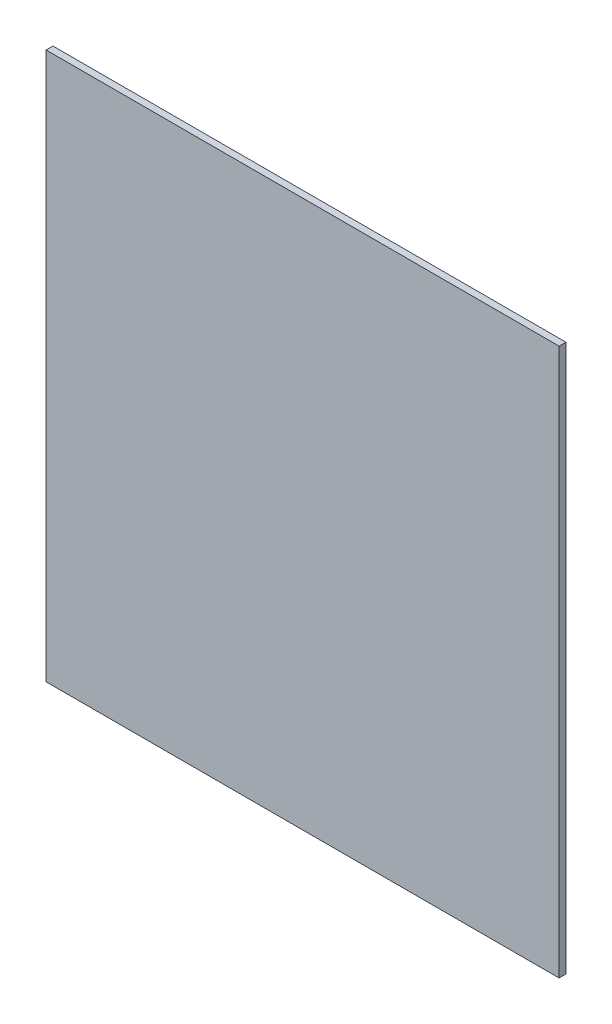
ISO-10303-21;
HEADER;
FILE_DESCRIPTION(('STEP AP214'),'2;1');
FILE_NAME('part.step','',(''),(''),'','','');
FILE_SCHEMA(('AUTOMOTIVE_DESIGN { 1 0 10303 214 1 1 1 1 }'));
ENDSEC;
DATA;
#1=APPLICATION_CONTEXT('core data for automotive mechanical design processes');
#2=APPLICATION_PROTOCOL_DEFINITION('international standard','automotive_design',2000,#1);
#3=PRODUCT_CONTEXT('',#1,'mechanical');
#4=PRODUCT('Part','Part','',(#3));
#5=PRODUCT_RELATED_PRODUCT_CATEGORY('part','',(#4));
#6=PRODUCT_DEFINITION_FORMATION('','',#4);
#7=PRODUCT_DEFINITION_CONTEXT('part definition',#1,'design');
#8=PRODUCT_DEFINITION('design','',#6,#7);
#9=PRODUCT_DEFINITION_SHAPE('','',#8);
#10=(LENGTH_UNIT() NAMED_UNIT(*) SI_UNIT(.MILLI.,.METRE.));
#11=(NAMED_UNIT(*) PLANE_ANGLE_UNIT() SI_UNIT($,.RADIAN.));
#12=(NAMED_UNIT(*) SI_UNIT($,.STERADIAN.) SOLID_ANGLE_UNIT());
#13=UNCERTAINTY_MEASURE_WITH_UNIT(LENGTH_MEASURE(1.E-05),#10,'distance_accuracy_value','');
#14=(GEOMETRIC_REPRESENTATION_CONTEXT(3) GLOBAL_UNCERTAINTY_ASSIGNED_CONTEXT((#13)) GLOBAL_UNIT_ASSIGNED_CONTEXT((#10,
#11,#12)) REPRESENTATION_CONTEXT('',''));
#15=CARTESIAN_POINT('',(0.,0.,0.));
#16=DIRECTION('',(0.,0.,1.));
#17=DIRECTION('',(1.,0.,0.));
#18=AXIS2_PLACEMENT_3D('',#15,#16,#17);
#19=CARTESIAN_POINT('',(13.,232.1,-2.));
#20=DIRECTION('',(-1.,0.,0.));
#21=DIRECTION('',(0.,-1.,0.));
#22=AXIS2_PLACEMENT_3D('',#19,#20,#21);
#23=PLANE('',#22);
#24=DIRECTION('',(0.,-1.,0.));
#25=VECTOR('',#24,1.);
#26=CARTESIAN_POINT('',(13.,232.1,0.));
#27=LINE('',#26,#25);
#28=CARTESIAN_POINT('',(13.,232.1,0.));
#29=VERTEX_POINT('',#28);
#30=CARTESIAN_POINT('',(13.,72.1,0.));
#31=VERTEX_POINT('',#30);
#32=EDGE_CURVE('E97',#29,#31,#27,.T.);
#33=ORIENTED_EDGE('',*,*,#32,.F.);
#34=DIRECTION('',(0.,0.,1.));
#35=VECTOR('',#34,1.);
#36=CARTESIAN_POINT('',(13.,232.1,-2.));
#37=LINE('',#36,#35);
#38=CARTESIAN_POINT('',(13.,232.1,-2.));
#39=VERTEX_POINT('',#38);
#40=EDGE_CURVE('E11',#39,#29,#37,.T.);
#41=ORIENTED_EDGE('',*,*,#40,.F.);
#42=DIRECTION('',(0.,-1.,0.));
#43=VECTOR('',#42,1.);
#44=CARTESIAN_POINT('',(13.,232.1,-2.));
#45=LINE('',#44,#43);
#46=CARTESIAN_POINT('',(13.,72.1,-2.));
#47=VERTEX_POINT('',#46);
#48=EDGE_CURVE('E91',#39,#47,#45,.T.);
#49=ORIENTED_EDGE('',*,*,#48,.T.);
#50=DIRECTION('',(0.,0.,1.));
#51=VECTOR('',#50,1.);
#52=CARTESIAN_POINT('',(13.,72.1,-2.));
#53=LINE('',#52,#51);
#54=EDGE_CURVE('E36',#47,#31,#53,.T.);
#55=ORIENTED_EDGE('',*,*,#54,.T.);
#56=EDGE_LOOP('',(#33,#41,#49,#55));
#57=FACE_BOUND('',#56,.T.);
#58=ADVANCED_FACE('F33',(#57),#23,.T.);
#59=CARTESIAN_POINT('',(163.,232.1,-2.));
#60=DIRECTION('',(0.,1.,0.));
#61=DIRECTION('',(0.,0.,1.));
#62=AXIS2_PLACEMENT_3D('',#59,#60,#61);
#63=PLANE('',#62);
#64=DIRECTION('',(-1.,0.,0.));
#65=VECTOR('',#64,1.);
#66=CARTESIAN_POINT('',(163.,232.1,0.));
#67=LINE('',#66,#65);
#68=CARTESIAN_POINT('',(163.,232.1,0.));
#69=VERTEX_POINT('',#68);
#70=EDGE_CURVE('E93',#69,#29,#67,.T.);
#71=ORIENTED_EDGE('',*,*,#70,.F.);
#72=DIRECTION('',(0.,0.,1.));
#73=VECTOR('',#72,1.);
#74=CARTESIAN_POINT('',(163.,232.1,-2.));
#75=LINE('',#74,#73);
#76=CARTESIAN_POINT('',(163.,232.1,-2.));
#77=VERTEX_POINT('',#76);
#78=EDGE_CURVE('E42',#77,#69,#75,.T.);
#79=ORIENTED_EDGE('',*,*,#78,.F.);
#80=DIRECTION('',(-1.,0.,0.));
#81=VECTOR('',#80,1.);
#82=CARTESIAN_POINT('',(163.,232.1,-2.));
#83=LINE('',#82,#81);
#84=EDGE_CURVE('E88',#77,#39,#83,.T.);
#85=ORIENTED_EDGE('',*,*,#84,.T.);
#86=ORIENTED_EDGE('',*,*,#40,.T.);
#87=EDGE_LOOP('',(#71,#79,#85,#86));
#88=FACE_BOUND('',#87,.T.);
#89=ADVANCED_FACE('F107',(#88),#63,.T.);
#90=CARTESIAN_POINT('',(163.,72.1,-2.));
#91=DIRECTION('',(1.,0.,0.));
#92=DIRECTION('',(0.,1.,0.));
#93=AXIS2_PLACEMENT_3D('',#90,#91,#92);
#94=PLANE('',#93);
#95=DIRECTION('',(0.,1.,0.));
#96=VECTOR('',#95,1.);
#97=CARTESIAN_POINT('',(163.,72.1,0.));
#98=LINE('',#97,#96);
#99=CARTESIAN_POINT('',(163.,72.1,0.));
#100=VERTEX_POINT('',#99);
#101=EDGE_CURVE('E83',#100,#69,#98,.T.);
#102=ORIENTED_EDGE('',*,*,#101,.F.);
#103=DIRECTION('',(0.,0.,1.));
#104=VECTOR('',#103,1.);
#105=CARTESIAN_POINT('',(163.,72.1,-2.));
#106=LINE('',#105,#104);
#107=CARTESIAN_POINT('',(163.,72.1,-2.));
#108=VERTEX_POINT('',#107);
#109=EDGE_CURVE('E78',#108,#100,#106,.T.);
#110=ORIENTED_EDGE('',*,*,#109,.F.);
#111=DIRECTION('',(0.,1.,0.));
#112=VECTOR('',#111,1.);
#113=CARTESIAN_POINT('',(163.,72.1,-2.));
#114=LINE('',#113,#112);
#115=EDGE_CURVE('E81',#108,#77,#114,.T.);
#116=ORIENTED_EDGE('',*,*,#115,.T.);
#117=ORIENTED_EDGE('',*,*,#78,.T.);
#118=EDGE_LOOP('',(#102,#110,#116,#117));
#119=FACE_BOUND('',#118,.T.);
#120=ADVANCED_FACE('F80',(#119),#94,.T.);
#121=CARTESIAN_POINT('',(13.,72.1,-2.));
#122=DIRECTION('',(0.,-1.,0.));
#123=DIRECTION('',(0.,0.,-1.));
#124=AXIS2_PLACEMENT_3D('',#121,#122,#123);
#125=PLANE('',#124);
#126=DIRECTION('',(1.,0.,0.));
#127=VECTOR('',#126,1.);
#128=CARTESIAN_POINT('',(13.,72.1,0.));
#129=LINE('',#128,#127);
#130=EDGE_CURVE('E100',#31,#100,#129,.T.);
#131=ORIENTED_EDGE('',*,*,#130,.F.);
#132=ORIENTED_EDGE('',*,*,#54,.F.);
#133=DIRECTION('',(1.,0.,0.));
#134=VECTOR('',#133,1.);
#135=CARTESIAN_POINT('',(13.,72.1,-2.));
#136=LINE('',#135,#134);
#137=EDGE_CURVE('E87',#47,#108,#136,.T.);
#138=ORIENTED_EDGE('',*,*,#137,.T.);
#139=ORIENTED_EDGE('',*,*,#109,.T.);
#140=EDGE_LOOP('',(#131,#132,#138,#139));
#141=FACE_BOUND('',#140,.T.);
#142=ADVANCED_FACE('F90',(#141),#125,.T.);
#143=CARTESIAN_POINT('',(0.,0.,-2.));
#144=DIRECTION('',(0.,0.,1.));
#145=DIRECTION('',(1.,0.,0.));
#146=AXIS2_PLACEMENT_3D('',#143,#144,#145);
#147=PLANE('',#146);
#148=ORIENTED_EDGE('',*,*,#48,.F.);
#149=ORIENTED_EDGE('',*,*,#84,.F.);
#150=ORIENTED_EDGE('',*,*,#115,.F.);
#151=ORIENTED_EDGE('',*,*,#137,.F.);
#152=EDGE_LOOP('',(#148,#149,#150,#151));
#153=FACE_BOUND('',#152,.T.);
#154=ADVANCED_FACE('F86',(#153),#147,.F.);
#155=CARTESIAN_POINT('',(0.,0.,0.));
#156=DIRECTION('',(0.,0.,1.));
#157=DIRECTION('',(1.,0.,0.));
#158=AXIS2_PLACEMENT_3D('',#155,#156,#157);
#159=PLANE('',#158);
#160=ORIENTED_EDGE('',*,*,#32,.T.);
#161=ORIENTED_EDGE('',*,*,#130,.T.);
#162=ORIENTED_EDGE('',*,*,#101,.T.);
#163=ORIENTED_EDGE('',*,*,#70,.T.);
#164=EDGE_LOOP('',(#160,#161,#162,#163));
#165=FACE_BOUND('',#164,.T.);
#166=ADVANCED_FACE('F106',(#165),#159,.T.);
#167=CLOSED_SHELL('',(#58,#89,#120,#142,#154,#166));
#168=MANIFOLD_SOLID_BREP('B2',#167);
#169=ADVANCED_BREP_SHAPE_REPRESENTATION('',(#18,#168),#14);
#170=SHAPE_DEFINITION_REPRESENTATION(#9,#169);
ENDSEC;
END-ISO-10303-21;
